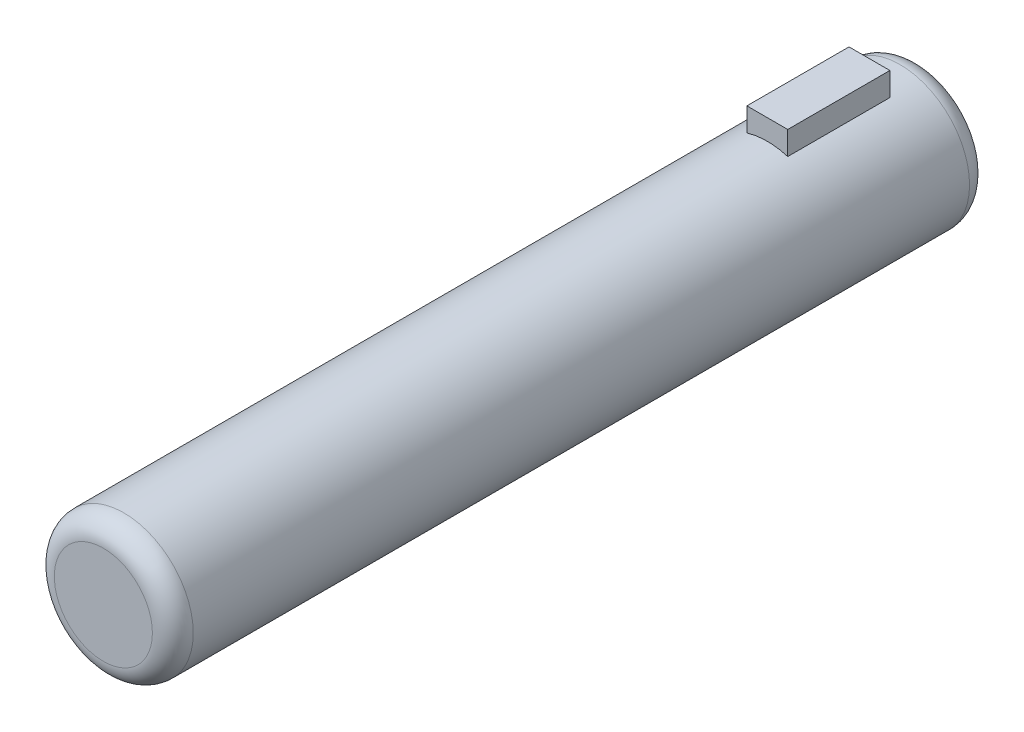
ISO-10303-21;
HEADER;
FILE_DESCRIPTION(('STEP AP214'),'2;1');
FILE_NAME('part.step','',(''),(''),'','','');
FILE_SCHEMA(('AUTOMOTIVE_DESIGN { 1 0 10303 214 1 1 1 1 }'));
ENDSEC;
DATA;
#1=APPLICATION_CONTEXT('core data for automotive mechanical design processes');
#2=APPLICATION_PROTOCOL_DEFINITION('international standard','automotive_design',2000,#1);
#3=PRODUCT_CONTEXT('',#1,'mechanical');
#4=PRODUCT('Part','Part','',(#3));
#5=PRODUCT_RELATED_PRODUCT_CATEGORY('part','',(#4));
#6=PRODUCT_DEFINITION_FORMATION('','',#4);
#7=PRODUCT_DEFINITION_CONTEXT('part definition',#1,'design');
#8=PRODUCT_DEFINITION('design','',#6,#7);
#9=PRODUCT_DEFINITION_SHAPE('','',#8);
#10=(LENGTH_UNIT() NAMED_UNIT(*) SI_UNIT(.MILLI.,.METRE.));
#11=(NAMED_UNIT(*) PLANE_ANGLE_UNIT() SI_UNIT($,.RADIAN.));
#12=(NAMED_UNIT(*) SI_UNIT($,.STERADIAN.) SOLID_ANGLE_UNIT());
#13=UNCERTAINTY_MEASURE_WITH_UNIT(LENGTH_MEASURE(1.E-05),#10,'distance_accuracy_value','');
#14=(GEOMETRIC_REPRESENTATION_CONTEXT(3) GLOBAL_UNCERTAINTY_ASSIGNED_CONTEXT((#13)) GLOBAL_UNIT_ASSIGNED_CONTEXT((#10,
#11,#12)) REPRESENTATION_CONTEXT('',''));
#15=CARTESIAN_POINT('',(0.,0.,0.));
#16=DIRECTION('',(0.,0.,1.));
#17=DIRECTION('',(1.,0.,0.));
#18=AXIS2_PLACEMENT_3D('',#15,#16,#17);
#19=CARTESIAN_POINT('',(0.,0.,40.));
#20=DIRECTION('',(0.,0.,-1.));
#21=DIRECTION('',(-1.,0.,0.));
#22=AXIS2_PLACEMENT_3D('',#19,#20,#21);
#23=CYLINDRICAL_SURFACE('',#22,3.4);
#24=DIRECTION('',(0.,0.,-1.));
#25=VECTOR('',#24,1.);
#26=CARTESIAN_POINT('',(1.,3.24961536185438,7.5));
#27=LINE('',#26,#25);
#28=CARTESIAN_POINT('',(1.,3.24961536185438,7.5));
#29=VERTEX_POINT('',#28);
#30=CARTESIAN_POINT('',(1.,3.24961536185438,2.5));
#31=VERTEX_POINT('',#30);
#32=EDGE_CURVE('E60',#29,#31,#27,.T.);
#33=ORIENTED_EDGE('',*,*,#32,.F.);
#34=CARTESIAN_POINT('',(0.,0.,7.5));
#35=DIRECTION('',(0.,0.,-1.));
#36=DIRECTION('',(1.,0.,0.));
#37=AXIS2_PLACEMENT_3D('',#34,#35,#36);
#38=CIRCLE('',#37,3.40000000000002);
#39=CARTESIAN_POINT('',(-1.,3.24961536185438,7.5));
#40=VERTEX_POINT('',#39);
#41=EDGE_CURVE('E55',#40,#29,#38,.T.);
#42=ORIENTED_EDGE('',*,*,#41,.F.);
#43=DIRECTION('',(0.,0.,-1.));
#44=VECTOR('',#43,1.);
#45=CARTESIAN_POINT('',(-1.,3.24961536185438,7.5));
#46=LINE('',#45,#44);
#47=CARTESIAN_POINT('',(-1.,3.24961536185438,2.5));
#48=VERTEX_POINT('',#47);
#49=EDGE_CURVE('E121',#40,#48,#46,.T.);
#50=ORIENTED_EDGE('',*,*,#49,.T.);
#51=CARTESIAN_POINT('',(0.,0.,2.5));
#52=DIRECTION('',(0.,0.,-1.));
#53=DIRECTION('',(1.,0.,0.));
#54=AXIS2_PLACEMENT_3D('',#51,#52,#53);
#55=CIRCLE('',#54,3.40000000000002);
#56=EDGE_CURVE('E110',#48,#31,#55,.T.);
#57=ORIENTED_EDGE('',*,*,#56,.T.);
#58=EDGE_LOOP('',(#33,#42,#50,#57));
#59=FACE_BOUND('',#58,.T.);
#60=CARTESIAN_POINT('',(0.,0.,1.));
#61=DIRECTION('',(0.,0.,1.));
#62=DIRECTION('',(1.,0.,0.));
#63=AXIS2_PLACEMENT_3D('',#60,#61,#62);
#64=CIRCLE('',#63,3.4);
#65=CARTESIAN_POINT('',(3.4,0.,1.));
#66=VERTEX_POINT('',#65);
#67=EDGE_CURVE('E128',#66,#66,#64,.T.);
#68=ORIENTED_EDGE('',*,*,#67,.T.);
#69=EDGE_LOOP('',(#68));
#70=FACE_BOUND('',#69,.T.);
#71=CARTESIAN_POINT('',(0.,0.,39.));
#72=DIRECTION('',(0.,0.,1.));
#73=DIRECTION('',(1.,0.,0.));
#74=AXIS2_PLACEMENT_3D('',#71,#72,#73);
#75=CIRCLE('',#74,3.4);
#76=CARTESIAN_POINT('',(3.4,0.,39.));
#77=VERTEX_POINT('',#76);
#78=EDGE_CURVE('E124',#77,#77,#75,.F.);
#79=ORIENTED_EDGE('',*,*,#78,.T.);
#80=EDGE_LOOP('',(#79));
#81=FACE_BOUND('',#80,.T.);
#82=ADVANCED_FACE('F39',(#59,#70,#81),#23,.T.);
#83=CARTESIAN_POINT('',(0.,0.,40.));
#84=DIRECTION('',(0.,0.,1.));
#85=DIRECTION('',(1.,0.,0.));
#86=AXIS2_PLACEMENT_3D('',#83,#84,#85);
#87=PLANE('',#86);
#88=CARTESIAN_POINT('',(0.,0.,40.));
#89=DIRECTION('',(0.,0.,1.));
#90=DIRECTION('',(1.,0.,0.));
#91=AXIS2_PLACEMENT_3D('',#88,#89,#90);
#92=CIRCLE('',#91,2.4);
#93=CARTESIAN_POINT('',(2.4,0.,40.));
#94=VERTEX_POINT('',#93);
#95=EDGE_CURVE('E11',#94,#94,#92,.T.);
#96=ORIENTED_EDGE('',*,*,#95,.T.);
#97=EDGE_LOOP('',(#96));
#98=FACE_BOUND('',#97,.T.);
#99=ADVANCED_FACE('F144',(#98),#87,.T.);
#100=CARTESIAN_POINT('',(0.,0.,0.));
#101=DIRECTION('',(0.,0.,1.));
#102=DIRECTION('',(1.,0.,0.));
#103=AXIS2_PLACEMENT_3D('',#100,#101,#102);
#104=PLANE('',#103);
#105=CARTESIAN_POINT('',(0.,0.,0.));
#106=DIRECTION('',(0.,0.,1.));
#107=DIRECTION('',(1.,0.,0.));
#108=AXIS2_PLACEMENT_3D('',#105,#106,#107);
#109=CIRCLE('',#108,2.4);
#110=CARTESIAN_POINT('',(2.4,0.,0.));
#111=VERTEX_POINT('',#110);
#112=EDGE_CURVE('E48',#111,#111,#109,.F.);
#113=ORIENTED_EDGE('',*,*,#112,.T.);
#114=EDGE_LOOP('',(#113));
#115=FACE_BOUND('',#114,.T.);
#116=ADVANCED_FACE('F135',(#115),#104,.F.);
#117=CARTESIAN_POINT('',(0.,0.,1.));
#118=DIRECTION('',(0.,0.,1.));
#119=DIRECTION('',(1.,0.,0.));
#120=AXIS2_PLACEMENT_3D('',#117,#118,#119);
#121=TOROIDAL_SURFACE('',#120,2.4,1.);
#122=ORIENTED_EDGE('',*,*,#112,.F.);
#123=EDGE_LOOP('',(#122));
#124=FACE_BOUND('',#123,.T.);
#125=ORIENTED_EDGE('',*,*,#67,.F.);
#126=EDGE_LOOP('',(#125));
#127=FACE_BOUND('',#126,.T.);
#128=ADVANCED_FACE('F137',(#124,#127),#121,.T.);
#129=CARTESIAN_POINT('',(0.,0.,39.));
#130=DIRECTION('',(0.,0.,1.));
#131=DIRECTION('',(1.,0.,0.));
#132=AXIS2_PLACEMENT_3D('',#129,#130,#131);
#133=TOROIDAL_SURFACE('',#132,2.4,1.);
#134=ORIENTED_EDGE('',*,*,#78,.F.);
#135=EDGE_LOOP('',(#134));
#136=FACE_BOUND('',#135,.T.);
#137=ORIENTED_EDGE('',*,*,#95,.F.);
#138=EDGE_LOOP('',(#137));
#139=FACE_BOUND('',#138,.T.);
#140=ADVANCED_FACE('F41',(#136,#139),#133,.T.);
#141=CARTESIAN_POINT('',(-1.,3.24961536185438,7.5));
#142=DIRECTION('',(1.,0.,0.));
#143=DIRECTION('',(0.,0.,-1.));
#144=AXIS2_PLACEMENT_3D('',#141,#142,#143);
#145=PLANE('',#144);
#146=DIRECTION('',(0.,-1.,0.));
#147=VECTOR('',#146,1.);
#148=CARTESIAN_POINT('',(-1.,3.24961536185438,2.5));
#149=LINE('',#148,#147);
#150=CARTESIAN_POINT('',(-1.,4.39961536185438,2.5));
#151=VERTEX_POINT('',#150);
#152=EDGE_CURVE('E106',#151,#48,#149,.T.);
#153=ORIENTED_EDGE('',*,*,#152,.T.);
#154=ORIENTED_EDGE('',*,*,#49,.F.);
#155=DIRECTION('',(0.,-1.,0.));
#156=VECTOR('',#155,1.);
#157=CARTESIAN_POINT('',(-1.,3.24961536185438,7.5));
#158=LINE('',#157,#156);
#159=CARTESIAN_POINT('',(-1.,4.39961536185438,7.5));
#160=VERTEX_POINT('',#159);
#161=EDGE_CURVE('E117',#160,#40,#158,.T.);
#162=ORIENTED_EDGE('',*,*,#161,.F.);
#163=DIRECTION('',(0.,0.,-1.));
#164=VECTOR('',#163,1.);
#165=CARTESIAN_POINT('',(-1.,4.39961536185438,7.5));
#166=LINE('',#165,#164);
#167=EDGE_CURVE('E95',#160,#151,#166,.T.);
#168=ORIENTED_EDGE('',*,*,#167,.T.);
#169=EDGE_LOOP('',(#153,#154,#162,#168));
#170=FACE_BOUND('',#169,.T.);
#171=ADVANCED_FACE('F150',(#170),#145,.F.);
#172=CARTESIAN_POINT('',(1.,3.24961536185438,7.5));
#173=DIRECTION('',(-1.,0.,0.));
#174=DIRECTION('',(0.,0.,1.));
#175=AXIS2_PLACEMENT_3D('',#172,#173,#174);
#176=PLANE('',#175);
#177=DIRECTION('',(0.,1.,0.));
#178=VECTOR('',#177,1.);
#179=CARTESIAN_POINT('',(1.,3.24961536185438,2.5));
#180=LINE('',#179,#178);
#181=CARTESIAN_POINT('',(1.,4.39961536185438,2.5));
#182=VERTEX_POINT('',#181);
#183=EDGE_CURVE('E91',#31,#182,#180,.T.);
#184=ORIENTED_EDGE('',*,*,#183,.T.);
#185=DIRECTION('',(0.,0.,-1.));
#186=VECTOR('',#185,1.);
#187=CARTESIAN_POINT('',(1.,4.39961536185438,7.5));
#188=LINE('',#187,#186);
#189=CARTESIAN_POINT('',(1.,4.39961536185438,7.5));
#190=VERTEX_POINT('',#189);
#191=EDGE_CURVE('E88',#190,#182,#188,.T.);
#192=ORIENTED_EDGE('',*,*,#191,.F.);
#193=DIRECTION('',(0.,1.,0.));
#194=VECTOR('',#193,1.);
#195=CARTESIAN_POINT('',(1.,3.24961536185438,7.5));
#196=LINE('',#195,#194);
#197=EDGE_CURVE('E78',#29,#190,#196,.T.);
#198=ORIENTED_EDGE('',*,*,#197,.F.);
#199=ORIENTED_EDGE('',*,*,#32,.T.);
#200=EDGE_LOOP('',(#184,#192,#198,#199));
#201=FACE_BOUND('',#200,.T.);
#202=ADVANCED_FACE('F89',(#201),#176,.F.);
#203=CARTESIAN_POINT('',(1.,4.39961536185438,7.5));
#204=DIRECTION('',(0.,-1.,0.));
#205=DIRECTION('',(0.,0.,-1.));
#206=AXIS2_PLACEMENT_3D('',#203,#204,#205);
#207=PLANE('',#206);
#208=DIRECTION('',(-1.,0.,0.));
#209=VECTOR('',#208,1.);
#210=CARTESIAN_POINT('',(1.,4.39961536185438,2.5));
#211=LINE('',#210,#209);
#212=EDGE_CURVE('E115',#182,#151,#211,.T.);
#213=ORIENTED_EDGE('',*,*,#212,.T.);
#214=ORIENTED_EDGE('',*,*,#167,.F.);
#215=DIRECTION('',(-1.,0.,0.));
#216=VECTOR('',#215,1.);
#217=CARTESIAN_POINT('',(1.,4.39961536185438,7.5));
#218=LINE('',#217,#216);
#219=EDGE_CURVE('E82',#190,#160,#218,.T.);
#220=ORIENTED_EDGE('',*,*,#219,.F.);
#221=ORIENTED_EDGE('',*,*,#191,.T.);
#222=EDGE_LOOP('',(#213,#214,#220,#221));
#223=FACE_BOUND('',#222,.T.);
#224=ADVANCED_FACE('F97',(#223),#207,.F.);
#225=CARTESIAN_POINT('',(0.,0.,7.5));
#226=DIRECTION('',(0.,0.,1.));
#227=DIRECTION('',(1.,0.,0.));
#228=AXIS2_PLACEMENT_3D('',#225,#226,#227);
#229=PLANE('',#228);
#230=ORIENTED_EDGE('',*,*,#161,.T.);
#231=ORIENTED_EDGE('',*,*,#41,.T.);
#232=ORIENTED_EDGE('',*,*,#197,.T.);
#233=ORIENTED_EDGE('',*,*,#219,.T.);
#234=EDGE_LOOP('',(#230,#231,#232,#233));
#235=FACE_BOUND('',#234,.T.);
#236=ADVANCED_FACE('F80',(#235),#229,.T.);
#237=CARTESIAN_POINT('',(0.,0.,2.5));
#238=DIRECTION('',(0.,0.,1.));
#239=DIRECTION('',(1.,0.,0.));
#240=AXIS2_PLACEMENT_3D('',#237,#238,#239);
#241=PLANE('',#240);
#242=ORIENTED_EDGE('',*,*,#152,.F.);
#243=ORIENTED_EDGE('',*,*,#212,.F.);
#244=ORIENTED_EDGE('',*,*,#183,.F.);
#245=ORIENTED_EDGE('',*,*,#56,.F.);
#246=EDGE_LOOP('',(#242,#243,#244,#245));
#247=FACE_BOUND('',#246,.T.);
#248=ADVANCED_FACE('F167',(#247),#241,.F.);
#249=CLOSED_SHELL('',(#82,#99,#116,#128,#140,#171,#202,#224,#236,#248));
#250=MANIFOLD_SOLID_BREP('B2',#249);
#251=ADVANCED_BREP_SHAPE_REPRESENTATION('',(#18,#250),#14);
#252=SHAPE_DEFINITION_REPRESENTATION(#9,#251);
ENDSEC;
END-ISO-10303-21;
